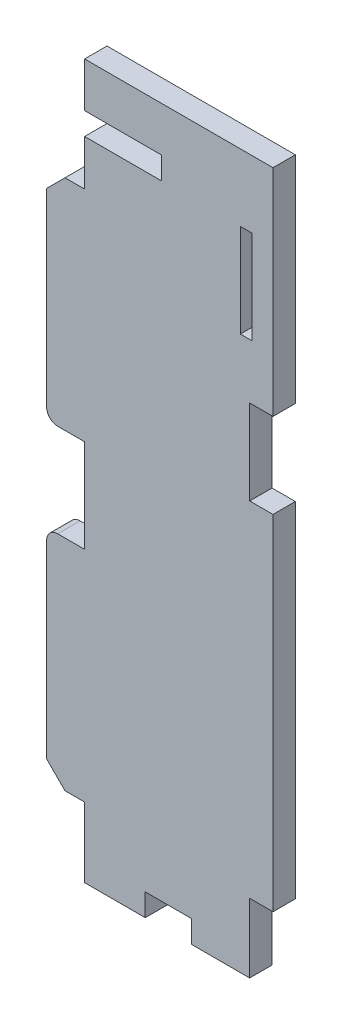
ISO-10303-21;
HEADER;
FILE_DESCRIPTION(('STEP AP214'),'2;1');
FILE_NAME('part.step','',(''),(''),'','','');
FILE_SCHEMA(('AUTOMOTIVE_DESIGN { 1 0 10303 214 1 1 1 1 }'));
ENDSEC;
DATA;
#1=APPLICATION_CONTEXT('core data for automotive mechanical design processes');
#2=APPLICATION_PROTOCOL_DEFINITION('international standard','automotive_design',2000,#1);
#3=PRODUCT_CONTEXT('',#1,'mechanical');
#4=PRODUCT('Part','Part','',(#3));
#5=PRODUCT_RELATED_PRODUCT_CATEGORY('part','',(#4));
#6=PRODUCT_DEFINITION_FORMATION('','',#4);
#7=PRODUCT_DEFINITION_CONTEXT('part definition',#1,'design');
#8=PRODUCT_DEFINITION('design','',#6,#7);
#9=PRODUCT_DEFINITION_SHAPE('','',#8);
#10=(LENGTH_UNIT() NAMED_UNIT(*) SI_UNIT(.MILLI.,.METRE.));
#11=(NAMED_UNIT(*) PLANE_ANGLE_UNIT() SI_UNIT($,.RADIAN.));
#12=(NAMED_UNIT(*) SI_UNIT($,.STERADIAN.) SOLID_ANGLE_UNIT());
#13=UNCERTAINTY_MEASURE_WITH_UNIT(LENGTH_MEASURE(1.E-05),#10,'distance_accuracy_value','');
#14=(GEOMETRIC_REPRESENTATION_CONTEXT(3) GLOBAL_UNCERTAINTY_ASSIGNED_CONTEXT((#13)) GLOBAL_UNIT_ASSIGNED_CONTEXT((#10,
#11,#12)) REPRESENTATION_CONTEXT('',''));
#15=CARTESIAN_POINT('',(0.,0.,0.));
#16=DIRECTION('',(0.,0.,1.));
#17=DIRECTION('',(1.,0.,0.));
#18=AXIS2_PLACEMENT_3D('',#15,#16,#17);
#19=CARTESIAN_POINT('',(1.49999999999995,37.8165,3.048));
#20=DIRECTION('',(0.,0.,1.));
#21=DIRECTION('',(1.,0.,0.));
#22=AXIS2_PLACEMENT_3D('',#19,#20,#21);
#23=PLANE('',#22);
#24=CARTESIAN_POINT('',(1.49999999999995,37.8165,3.048));
#25=DIRECTION('',(0.,0.,1.));
#26=DIRECTION('',(1.,0.,0.));
#27=AXIS2_PLACEMENT_3D('',#24,#25,#26);
#28=CIRCLE('',#27,1.49999999999997);
#29=CARTESIAN_POINT('',(1.49999999999995,39.3165,3.048));
#30=VERTEX_POINT('',#29);
#31=CARTESIAN_POINT('',(0.,37.8165,3.048));
#32=VERTEX_POINT('',#31);
#33=EDGE_CURVE('E289',#30,#32,#28,.T.);
#34=ORIENTED_EDGE('',*,*,#33,.T.);
#35=DIRECTION('',(0.,-1.,0.));
#36=VECTOR('',#35,1.);
#37=CARTESIAN_POINT('',(0.,12.01,3.048));
#38=LINE('',#37,#36);
#39=CARTESIAN_POINT('',(0.,12.01,3.048));
#40=VERTEX_POINT('',#39);
#41=EDGE_CURVE('E292',#32,#40,#38,.T.);
#42=ORIENTED_EDGE('',*,*,#41,.T.);
#43=DIRECTION('',(0.707106781186547,-0.707106781186549,0.));
#44=VECTOR('',#43,1.);
#45=CARTESIAN_POINT('',(0.,12.01,3.048));
#46=LINE('',#45,#44);
#47=CARTESIAN_POINT('',(2.5,9.50999999999997,3.048));
#48=VERTEX_POINT('',#47);
#49=EDGE_CURVE('E295',#40,#48,#46,.T.);
#50=ORIENTED_EDGE('',*,*,#49,.T.);
#51=DIRECTION('',(1.,0.,0.));
#52=VECTOR('',#51,1.);
#53=CARTESIAN_POINT('',(5.16999999999984,9.50999999999997,3.048));
#54=LINE('',#53,#52);
#55=CARTESIAN_POINT('',(5.16999999999984,9.50999999999997,3.048));
#56=VERTEX_POINT('',#55);
#57=EDGE_CURVE('E297',#48,#56,#54,.T.);
#58=ORIENTED_EDGE('',*,*,#57,.T.);
#59=DIRECTION('',(0.,-1.,0.));
#60=VECTOR('',#59,1.);
#61=CARTESIAN_POINT('',(5.16999999999984,9.50999999999997,3.048));
#62=LINE('',#61,#60);
#63=CARTESIAN_POINT('',(5.1699999999999,0.,3.048));
#64=VERTEX_POINT('',#63);
#65=EDGE_CURVE('E299',#56,#64,#62,.T.);
#66=ORIENTED_EDGE('',*,*,#65,.T.);
#67=DIRECTION('',(1.,0.,0.));
#68=VECTOR('',#67,1.);
#69=CARTESIAN_POINT('',(13.4249996441229,0.,3.048));
#70=LINE('',#69,#68);
#71=CARTESIAN_POINT('',(13.4249996441229,0.,3.048));
#72=VERTEX_POINT('',#71);
#73=EDGE_CURVE('E301',#64,#72,#70,.T.);
#74=ORIENTED_EDGE('',*,*,#73,.T.);
#75=DIRECTION('',(0.,1.,0.));
#76=VECTOR('',#75,1.);
#77=CARTESIAN_POINT('',(13.4249996441229,0.,3.048));
#78=LINE('',#77,#76);
#79=CARTESIAN_POINT('',(13.4249996441229,3.04799992591143,3.048));
#80=VERTEX_POINT('',#79);
#81=EDGE_CURVE('E303',#72,#80,#78,.T.);
#82=ORIENTED_EDGE('',*,*,#81,.T.);
#83=DIRECTION('',(1.,0.,0.));
#84=VECTOR('',#83,1.);
#85=CARTESIAN_POINT('',(19.7241991805657,3.04799992591143,3.048));
#86=LINE('',#85,#84);
#87=CARTESIAN_POINT('',(19.7241991805657,3.04799992591143,3.048));
#88=VERTEX_POINT('',#87);
#89=EDGE_CURVE('E305',#80,#88,#86,.T.);
#90=ORIENTED_EDGE('',*,*,#89,.T.);
#91=DIRECTION('',(0.,-1.,0.));
#92=VECTOR('',#91,1.);
#93=CARTESIAN_POINT('',(19.7241991805657,0.,3.048));
#94=LINE('',#93,#92);
#95=CARTESIAN_POINT('',(19.7241991805657,0.,3.048));
#96=VERTEX_POINT('',#95);
#97=EDGE_CURVE('E307',#88,#96,#94,.T.);
#98=ORIENTED_EDGE('',*,*,#97,.T.);
#99=DIRECTION('',(1.,0.,0.));
#100=VECTOR('',#99,1.);
#101=CARTESIAN_POINT('',(27.6489999192578,0.,3.048));
#102=LINE('',#101,#100);
#103=CARTESIAN_POINT('',(27.6489999192578,0.,3.048));
#104=VERTEX_POINT('',#103);
#105=EDGE_CURVE('E309',#96,#104,#102,.T.);
#106=ORIENTED_EDGE('',*,*,#105,.T.);
#107=DIRECTION('',(0.,1.,0.));
#108=VECTOR('',#107,1.);
#109=CARTESIAN_POINT('',(27.6489999192578,0.,3.048));
#110=LINE('',#109,#108);
#111=CARTESIAN_POINT('',(27.6489999192578,9.39799984917045,3.048));
#112=VERTEX_POINT('',#111);
#113=EDGE_CURVE('E311',#104,#112,#110,.T.);
#114=ORIENTED_EDGE('',*,*,#113,.T.);
#115=DIRECTION('',(1.,0.,0.));
#116=VECTOR('',#115,1.);
#117=CARTESIAN_POINT('',(27.6489999192578,9.39799984917045,3.048));
#118=LINE('',#117,#116);
#119=CARTESIAN_POINT('',(30.8239996480567,9.39799984917045,3.048));
#120=VERTEX_POINT('',#119);
#121=EDGE_CURVE('E313',#112,#120,#118,.T.);
#122=ORIENTED_EDGE('',*,*,#121,.T.);
#123=DIRECTION('',(0.,1.,0.));
#124=VECTOR('',#123,1.);
#125=CARTESIAN_POINT('',(30.8239996480567,9.39799984917045,3.048));
#126=LINE('',#125,#124);
#127=CARTESIAN_POINT('',(30.8239996480567,56.2610002234578,3.048));
#128=VERTEX_POINT('',#127);
#129=EDGE_CURVE('E315',#120,#128,#126,.T.);
#130=ORIENTED_EDGE('',*,*,#129,.T.);
#131=DIRECTION('',(-1.,0.,0.));
#132=VECTOR('',#131,1.);
#133=CARTESIAN_POINT('',(30.8239996480567,56.2610002234578,3.048));
#134=LINE('',#133,#132);
#135=CARTESIAN_POINT('',(27.6489999192578,56.2610002234578,3.048));
#136=VERTEX_POINT('',#135);
#137=EDGE_CURVE('E317',#128,#136,#134,.T.);
#138=ORIENTED_EDGE('',*,*,#137,.T.);
#139=DIRECTION('',(0.,1.,0.));
#140=VECTOR('',#139,1.);
#141=CARTESIAN_POINT('',(27.6489999192578,67.8179981186986,3.048));
#142=LINE('',#141,#140);
#143=CARTESIAN_POINT('',(27.6489999192578,67.8179981186986,3.048));
#144=VERTEX_POINT('',#143);
#145=EDGE_CURVE('E319',#136,#144,#142,.T.);
#146=ORIENTED_EDGE('',*,*,#145,.T.);
#147=DIRECTION('',(1.,0.,0.));
#148=VECTOR('',#147,1.);
#149=CARTESIAN_POINT('',(30.8239996480567,67.8179981186986,3.048));
#150=LINE('',#149,#148);
#151=CARTESIAN_POINT('',(30.8239996480567,67.8179981186986,3.048));
#152=VERTEX_POINT('',#151);
#153=EDGE_CURVE('E321',#144,#152,#150,.T.);
#154=ORIENTED_EDGE('',*,*,#153,.T.);
#155=DIRECTION('',(0.,1.,0.));
#156=VECTOR('',#155,1.);
#157=CARTESIAN_POINT('',(30.8239996480567,97.1549870446324,3.048));
#158=LINE('',#157,#156);
#159=CARTESIAN_POINT('',(30.8239996480567,97.1549870446324,3.048));
#160=VERTEX_POINT('',#159);
#161=EDGE_CURVE('E323',#152,#160,#158,.T.);
#162=ORIENTED_EDGE('',*,*,#161,.T.);
#163=DIRECTION('',(-1.,0.,0.));
#164=VECTOR('',#163,1.);
#165=CARTESIAN_POINT('',(5.1699999999999,97.1549870446324,3.048));
#166=LINE('',#165,#164);
#167=CARTESIAN_POINT('',(5.1699999999999,97.1549870446324,3.048));
#168=VERTEX_POINT('',#167);
#169=EDGE_CURVE('E325',#160,#168,#166,.T.);
#170=ORIENTED_EDGE('',*,*,#169,.T.);
#171=DIRECTION('',(0.,-1.,0.));
#172=VECTOR('',#171,1.);
#173=CARTESIAN_POINT('',(5.1699999999999,97.1549870446324,3.048));
#174=LINE('',#173,#172);
#175=CARTESIAN_POINT('',(5.1699999999999,91.0589965060353,3.048));
#176=VERTEX_POINT('',#175);
#177=EDGE_CURVE('E327',#168,#176,#174,.T.);
#178=ORIENTED_EDGE('',*,*,#177,.T.);
#179=DIRECTION('',(1.,0.,0.));
#180=VECTOR('',#179,1.);
#181=CARTESIAN_POINT('',(15.6347999396547,91.0589965060353,3.048));
#182=LINE('',#181,#180);
#183=CARTESIAN_POINT('',(15.6347999396547,91.0589965060353,3.048));
#184=VERTEX_POINT('',#183);
#185=EDGE_CURVE('E329',#176,#184,#182,.T.);
#186=ORIENTED_EDGE('',*,*,#185,.T.);
#187=DIRECTION('',(0.,-1.,0.));
#188=VECTOR('',#187,1.);
#189=CARTESIAN_POINT('',(15.6347999396547,91.0589965060353,3.048));
#190=LINE('',#189,#188);
#191=CARTESIAN_POINT('',(15.6347999396547,88.0110012367368,3.048));
#192=VERTEX_POINT('',#191);
#193=EDGE_CURVE('E331',#184,#192,#190,.T.);
#194=ORIENTED_EDGE('',*,*,#193,.T.);
#195=DIRECTION('',(-1.,0.,0.));
#196=VECTOR('',#195,1.);
#197=CARTESIAN_POINT('',(15.6347999396547,88.0110012367368,3.048));
#198=LINE('',#197,#196);
#199=CARTESIAN_POINT('',(5.1699999999999,88.0110012367368,3.048));
#200=VERTEX_POINT('',#199);
#201=EDGE_CURVE('E333',#192,#200,#198,.T.);
#202=ORIENTED_EDGE('',*,*,#201,.T.);
#203=DIRECTION('',(0.,-1.,0.));
#204=VECTOR('',#203,1.);
#205=CARTESIAN_POINT('',(5.1699999999999,88.0110012367368,3.048));
#206=LINE('',#205,#204);
#207=CARTESIAN_POINT('',(5.1699999999999,81.803,3.048));
#208=VERTEX_POINT('',#207);
#209=EDGE_CURVE('E335',#200,#208,#206,.T.);
#210=ORIENTED_EDGE('',*,*,#209,.T.);
#211=DIRECTION('',(-1.,0.,0.));
#212=VECTOR('',#211,1.);
#213=CARTESIAN_POINT('',(2.5,81.803,3.048));
#214=LINE('',#213,#212);
#215=CARTESIAN_POINT('',(2.5,81.803,3.048));
#216=VERTEX_POINT('',#215);
#217=EDGE_CURVE('E337',#208,#216,#214,.T.);
#218=ORIENTED_EDGE('',*,*,#217,.T.);
#219=DIRECTION('',(-0.707106781186548,-0.707106781186548,0.));
#220=VECTOR('',#219,1.);
#221=CARTESIAN_POINT('',(2.5,81.803,3.048));
#222=LINE('',#221,#220);
#223=CARTESIAN_POINT('',(0.,79.3029999999999,3.048));
#224=VERTEX_POINT('',#223);
#225=EDGE_CURVE('E339',#216,#224,#222,.T.);
#226=ORIENTED_EDGE('',*,*,#225,.T.);
#227=DIRECTION('',(0.,-1.,0.));
#228=VECTOR('',#227,1.);
#229=CARTESIAN_POINT('',(0.,53.4965,3.048));
#230=LINE('',#229,#228);
#231=CARTESIAN_POINT('',(0.,53.4965,3.048));
#232=VERTEX_POINT('',#231);
#233=EDGE_CURVE('E341',#224,#232,#230,.T.);
#234=ORIENTED_EDGE('',*,*,#233,.T.);
#235=CARTESIAN_POINT('',(1.49999999999995,53.4965,3.048));
#236=DIRECTION('',(0.,0.,1.));
#237=DIRECTION('',(1.,0.,0.));
#238=AXIS2_PLACEMENT_3D('',#235,#236,#237);
#239=CIRCLE('',#238,1.5);
#240=CARTESIAN_POINT('',(1.49999999999995,51.9965,3.048));
#241=VERTEX_POINT('',#240);
#242=EDGE_CURVE('E343',#232,#241,#239,.T.);
#243=ORIENTED_EDGE('',*,*,#242,.T.);
#244=DIRECTION('',(1.,0.,0.));
#245=VECTOR('',#244,1.);
#246=CARTESIAN_POINT('',(5.1699999999999,51.9965,3.048));
#247=LINE('',#246,#245);
#248=CARTESIAN_POINT('',(5.1699999999999,51.9965,3.048));
#249=VERTEX_POINT('',#248);
#250=EDGE_CURVE('E345',#241,#249,#247,.T.);
#251=ORIENTED_EDGE('',*,*,#250,.T.);
#252=DIRECTION('',(0.,-1.,0.));
#253=VECTOR('',#252,1.);
#254=CARTESIAN_POINT('',(5.1699999999999,51.9965,3.048));
#255=LINE('',#254,#253);
#256=CARTESIAN_POINT('',(5.1699999999999,39.3165,3.048));
#257=VERTEX_POINT('',#256);
#258=EDGE_CURVE('E347',#249,#257,#255,.T.);
#259=ORIENTED_EDGE('',*,*,#258,.T.);
#260=DIRECTION('',(-1.,0.,0.));
#261=VECTOR('',#260,1.);
#262=CARTESIAN_POINT('',(1.49999999999995,39.3165,3.048));
#263=LINE('',#262,#261);
#264=EDGE_CURVE('E349',#257,#30,#263,.T.);
#265=ORIENTED_EDGE('',*,*,#264,.T.);
#266=EDGE_LOOP('',(#34,#42,#50,#58,#66,#74,#82,#90,#98,#106,#114,#122,#130,#138,#146,#154,#162,
#170,#178,#186,#194,#202,#210,#218,#226,#234,#243,#251,#259,#265));
#267=FACE_BOUND('',#266,.T.);
#268=DIRECTION('',(-1.,0.,0.));
#269=VECTOR('',#268,1.);
#270=CARTESIAN_POINT('',(27.9537994461877,88.0110012367368,3.048));
#271=LINE('',#270,#269);
#272=CARTESIAN_POINT('',(27.9537994461877,88.0110012367368,3.048));
#273=VERTEX_POINT('',#272);
#274=CARTESIAN_POINT('',(26.3790000277383,88.0110012367368,3.048));
#275=VERTEX_POINT('',#274);
#276=EDGE_CURVE('E261',#273,#275,#271,.T.);
#277=ORIENTED_EDGE('',*,*,#276,.F.);
#278=DIRECTION('',(0.,1.,0.));
#279=VECTOR('',#278,1.);
#280=CARTESIAN_POINT('',(27.9537994461877,75.3110023215413,3.048));
#281=LINE('',#280,#279);
#282=CARTESIAN_POINT('',(27.9537994461877,75.3110023215413,3.048));
#283=VERTEX_POINT('',#282);
#284=EDGE_CURVE('E253',#283,#273,#281,.T.);
#285=ORIENTED_EDGE('',*,*,#284,.F.);
#286=DIRECTION('',(1.,0.,0.));
#287=VECTOR('',#286,1.);
#288=CARTESIAN_POINT('',(26.3790000277383,75.3110023215413,3.048));
#289=LINE('',#288,#287);
#290=CARTESIAN_POINT('',(26.3790000277383,75.3110023215413,3.048));
#291=VERTEX_POINT('',#290);
#292=EDGE_CURVE('E275',#291,#283,#289,.T.);
#293=ORIENTED_EDGE('',*,*,#292,.F.);
#294=DIRECTION('',(0.,-1.,0.));
#295=VECTOR('',#294,1.);
#296=CARTESIAN_POINT('',(26.3790000277383,88.0110012367368,3.048));
#297=LINE('',#296,#295);
#298=EDGE_CURVE('E273',#275,#291,#297,.T.);
#299=ORIENTED_EDGE('',*,*,#298,.F.);
#300=EDGE_LOOP('',(#277,#285,#293,#299));
#301=FACE_BOUND('',#300,.T.);
#302=ADVANCED_FACE('F32',(#267,#301),#23,.T.);
#303=CARTESIAN_POINT('',(1.49999999999995,37.8165,0.));
#304=DIRECTION('',(0.,0.,1.));
#305=DIRECTION('',(1.,0.,0.));
#306=AXIS2_PLACEMENT_3D('',#303,#304,#305);
#307=PLANE('',#306);
#308=CARTESIAN_POINT('',(1.49999999999995,37.8165,0.));
#309=DIRECTION('',(0.,0.,1.));
#310=DIRECTION('',(1.,0.,0.));
#311=AXIS2_PLACEMENT_3D('',#308,#309,#310);
#312=CIRCLE('',#311,1.49999999999997);
#313=CARTESIAN_POINT('',(1.49999999999995,39.3165,0.));
#314=VERTEX_POINT('',#313);
#315=CARTESIAN_POINT('',(0.,37.8165,0.));
#316=VERTEX_POINT('',#315);
#317=EDGE_CURVE('E269',#314,#316,#312,.T.);
#318=ORIENTED_EDGE('',*,*,#317,.F.);
#319=DIRECTION('',(-1.,0.,0.));
#320=VECTOR('',#319,1.);
#321=CARTESIAN_POINT('',(1.49999999999995,39.3165,0.));
#322=LINE('',#321,#320);
#323=CARTESIAN_POINT('',(5.1699999999999,39.3165,0.));
#324=VERTEX_POINT('',#323);
#325=EDGE_CURVE('E293',#324,#314,#322,.T.);
#326=ORIENTED_EDGE('',*,*,#325,.F.);
#327=DIRECTION('',(0.,-1.,0.));
#328=VECTOR('',#327,1.);
#329=CARTESIAN_POINT('',(5.1699999999999,51.9965,0.));
#330=LINE('',#329,#328);
#331=CARTESIAN_POINT('',(5.1699999999999,51.9965,0.));
#332=VERTEX_POINT('',#331);
#333=EDGE_CURVE('E409',#332,#324,#330,.T.);
#334=ORIENTED_EDGE('',*,*,#333,.F.);
#335=DIRECTION('',(1.,0.,0.));
#336=VECTOR('',#335,1.);
#337=CARTESIAN_POINT('',(5.1699999999999,51.9965,0.));
#338=LINE('',#337,#336);
#339=CARTESIAN_POINT('',(1.49999999999995,51.9965,0.));
#340=VERTEX_POINT('',#339);
#341=EDGE_CURVE('E407',#340,#332,#338,.T.);
#342=ORIENTED_EDGE('',*,*,#341,.F.);
#343=CARTESIAN_POINT('',(1.49999999999995,53.4965,0.));
#344=DIRECTION('',(0.,0.,1.));
#345=DIRECTION('',(1.,0.,0.));
#346=AXIS2_PLACEMENT_3D('',#343,#344,#345);
#347=CIRCLE('',#346,1.5);
#348=CARTESIAN_POINT('',(0.,53.4965,0.));
#349=VERTEX_POINT('',#348);
#350=EDGE_CURVE('E405',#349,#340,#347,.T.);
#351=ORIENTED_EDGE('',*,*,#350,.F.);
#352=DIRECTION('',(0.,-1.,0.));
#353=VECTOR('',#352,1.);
#354=CARTESIAN_POINT('',(0.,53.4965,0.));
#355=LINE('',#354,#353);
#356=CARTESIAN_POINT('',(0.,79.3029999999999,0.));
#357=VERTEX_POINT('',#356);
#358=EDGE_CURVE('E403',#357,#349,#355,.T.);
#359=ORIENTED_EDGE('',*,*,#358,.F.);
#360=DIRECTION('',(-0.707106781186548,-0.707106781186548,0.));
#361=VECTOR('',#360,1.);
#362=CARTESIAN_POINT('',(2.5,81.803,0.));
#363=LINE('',#362,#361);
#364=CARTESIAN_POINT('',(2.5,81.803,0.));
#365=VERTEX_POINT('',#364);
#366=EDGE_CURVE('E401',#365,#357,#363,.T.);
#367=ORIENTED_EDGE('',*,*,#366,.F.);
#368=DIRECTION('',(-1.,0.,0.));
#369=VECTOR('',#368,1.);
#370=CARTESIAN_POINT('',(2.5,81.803,0.));
#371=LINE('',#370,#369);
#372=CARTESIAN_POINT('',(5.1699999999999,81.803,0.));
#373=VERTEX_POINT('',#372);
#374=EDGE_CURVE('E399',#373,#365,#371,.T.);
#375=ORIENTED_EDGE('',*,*,#374,.F.);
#376=DIRECTION('',(0.,-1.,0.));
#377=VECTOR('',#376,1.);
#378=CARTESIAN_POINT('',(5.1699999999999,88.0110012367368,0.));
#379=LINE('',#378,#377);
#380=CARTESIAN_POINT('',(5.1699999999999,88.0110012367368,0.));
#381=VERTEX_POINT('',#380);
#382=EDGE_CURVE('E397',#381,#373,#379,.T.);
#383=ORIENTED_EDGE('',*,*,#382,.F.);
#384=DIRECTION('',(-1.,0.,0.));
#385=VECTOR('',#384,1.);
#386=CARTESIAN_POINT('',(15.6347999396547,88.0110012367368,0.));
#387=LINE('',#386,#385);
#388=CARTESIAN_POINT('',(15.6347999396547,88.0110012367368,0.));
#389=VERTEX_POINT('',#388);
#390=EDGE_CURVE('E395',#389,#381,#387,.T.);
#391=ORIENTED_EDGE('',*,*,#390,.F.);
#392=DIRECTION('',(0.,-1.,0.));
#393=VECTOR('',#392,1.);
#394=CARTESIAN_POINT('',(15.6347999396547,91.0589965060353,0.));
#395=LINE('',#394,#393);
#396=CARTESIAN_POINT('',(15.6347999396547,91.0589965060353,0.));
#397=VERTEX_POINT('',#396);
#398=EDGE_CURVE('E393',#397,#389,#395,.T.);
#399=ORIENTED_EDGE('',*,*,#398,.F.);
#400=DIRECTION('',(1.,0.,0.));
#401=VECTOR('',#400,1.);
#402=CARTESIAN_POINT('',(15.6347999396547,91.0589965060353,0.));
#403=LINE('',#402,#401);
#404=CARTESIAN_POINT('',(5.1699999999999,91.0589965060353,0.));
#405=VERTEX_POINT('',#404);
#406=EDGE_CURVE('E391',#405,#397,#403,.T.);
#407=ORIENTED_EDGE('',*,*,#406,.F.);
#408=DIRECTION('',(0.,-1.,0.));
#409=VECTOR('',#408,1.);
#410=CARTESIAN_POINT('',(5.1699999999999,97.1549870446324,0.));
#411=LINE('',#410,#409);
#412=CARTESIAN_POINT('',(5.1699999999999,97.1549870446324,0.));
#413=VERTEX_POINT('',#412);
#414=EDGE_CURVE('E389',#413,#405,#411,.T.);
#415=ORIENTED_EDGE('',*,*,#414,.F.);
#416=DIRECTION('',(-1.,0.,0.));
#417=VECTOR('',#416,1.);
#418=CARTESIAN_POINT('',(5.1699999999999,97.1549870446324,0.));
#419=LINE('',#418,#417);
#420=CARTESIAN_POINT('',(30.8239996480567,97.1549870446324,0.));
#421=VERTEX_POINT('',#420);
#422=EDGE_CURVE('E387',#421,#413,#419,.T.);
#423=ORIENTED_EDGE('',*,*,#422,.F.);
#424=DIRECTION('',(0.,1.,0.));
#425=VECTOR('',#424,1.);
#426=CARTESIAN_POINT('',(30.8239996480567,97.1549870446324,0.));
#427=LINE('',#426,#425);
#428=CARTESIAN_POINT('',(30.8239996480567,67.8179981186986,0.));
#429=VERTEX_POINT('',#428);
#430=EDGE_CURVE('E385',#429,#421,#427,.T.);
#431=ORIENTED_EDGE('',*,*,#430,.F.);
#432=DIRECTION('',(1.,0.,0.));
#433=VECTOR('',#432,1.);
#434=CARTESIAN_POINT('',(30.8239996480567,67.8179981186986,0.));
#435=LINE('',#434,#433);
#436=CARTESIAN_POINT('',(27.6489999192578,67.8179981186986,0.));
#437=VERTEX_POINT('',#436);
#438=EDGE_CURVE('E383',#437,#429,#435,.T.);
#439=ORIENTED_EDGE('',*,*,#438,.F.);
#440=DIRECTION('',(0.,1.,0.));
#441=VECTOR('',#440,1.);
#442=CARTESIAN_POINT('',(27.6489999192578,67.8179981186986,0.));
#443=LINE('',#442,#441);
#444=CARTESIAN_POINT('',(27.6489999192578,56.2610002234578,0.));
#445=VERTEX_POINT('',#444);
#446=EDGE_CURVE('E381',#445,#437,#443,.T.);
#447=ORIENTED_EDGE('',*,*,#446,.F.);
#448=DIRECTION('',(-1.,0.,0.));
#449=VECTOR('',#448,1.);
#450=CARTESIAN_POINT('',(30.8239996480567,56.2610002234578,0.));
#451=LINE('',#450,#449);
#452=CARTESIAN_POINT('',(30.8239996480567,56.2610002234578,0.));
#453=VERTEX_POINT('',#452);
#454=EDGE_CURVE('E379',#453,#445,#451,.T.);
#455=ORIENTED_EDGE('',*,*,#454,.F.);
#456=DIRECTION('',(0.,1.,0.));
#457=VECTOR('',#456,1.);
#458=CARTESIAN_POINT('',(30.8239996480567,9.39799984917045,0.));
#459=LINE('',#458,#457);
#460=CARTESIAN_POINT('',(30.8239996480567,9.39799984917045,0.));
#461=VERTEX_POINT('',#460);
#462=EDGE_CURVE('E377',#461,#453,#459,.T.);
#463=ORIENTED_EDGE('',*,*,#462,.F.);
#464=DIRECTION('',(1.,0.,0.));
#465=VECTOR('',#464,1.);
#466=CARTESIAN_POINT('',(27.6489999192578,9.39799984917045,0.));
#467=LINE('',#466,#465);
#468=CARTESIAN_POINT('',(27.6489999192578,9.39799984917045,0.));
#469=VERTEX_POINT('',#468);
#470=EDGE_CURVE('E375',#469,#461,#467,.T.);
#471=ORIENTED_EDGE('',*,*,#470,.F.);
#472=DIRECTION('',(0.,1.,0.));
#473=VECTOR('',#472,1.);
#474=CARTESIAN_POINT('',(27.6489999192578,0.,0.));
#475=LINE('',#474,#473);
#476=CARTESIAN_POINT('',(27.6489999192578,0.,0.));
#477=VERTEX_POINT('',#476);
#478=EDGE_CURVE('E373',#477,#469,#475,.T.);
#479=ORIENTED_EDGE('',*,*,#478,.F.);
#480=DIRECTION('',(1.,0.,0.));
#481=VECTOR('',#480,1.);
#482=CARTESIAN_POINT('',(27.6489999192578,0.,0.));
#483=LINE('',#482,#481);
#484=CARTESIAN_POINT('',(19.7241991805657,0.,0.));
#485=VERTEX_POINT('',#484);
#486=EDGE_CURVE('E371',#485,#477,#483,.T.);
#487=ORIENTED_EDGE('',*,*,#486,.F.);
#488=DIRECTION('',(0.,-1.,0.));
#489=VECTOR('',#488,1.);
#490=CARTESIAN_POINT('',(19.7241991805657,0.,0.));
#491=LINE('',#490,#489);
#492=CARTESIAN_POINT('',(19.7241991805657,3.04799992591143,0.));
#493=VERTEX_POINT('',#492);
#494=EDGE_CURVE('E369',#493,#485,#491,.T.);
#495=ORIENTED_EDGE('',*,*,#494,.F.);
#496=DIRECTION('',(1.,0.,0.));
#497=VECTOR('',#496,1.);
#498=CARTESIAN_POINT('',(19.7241991805657,3.04799992591143,0.));
#499=LINE('',#498,#497);
#500=CARTESIAN_POINT('',(13.4249996441229,3.04799992591143,0.));
#501=VERTEX_POINT('',#500);
#502=EDGE_CURVE('E367',#501,#493,#499,.T.);
#503=ORIENTED_EDGE('',*,*,#502,.F.);
#504=DIRECTION('',(0.,1.,0.));
#505=VECTOR('',#504,1.);
#506=CARTESIAN_POINT('',(13.4249996441229,0.,0.));
#507=LINE('',#506,#505);
#508=CARTESIAN_POINT('',(13.4249996441229,0.,0.));
#509=VERTEX_POINT('',#508);
#510=EDGE_CURVE('E365',#509,#501,#507,.T.);
#511=ORIENTED_EDGE('',*,*,#510,.F.);
#512=DIRECTION('',(1.,0.,0.));
#513=VECTOR('',#512,1.);
#514=CARTESIAN_POINT('',(13.4249996441229,0.,0.));
#515=LINE('',#514,#513);
#516=CARTESIAN_POINT('',(5.1699999999999,0.,0.));
#517=VERTEX_POINT('',#516);
#518=EDGE_CURVE('E363',#517,#509,#515,.T.);
#519=ORIENTED_EDGE('',*,*,#518,.F.);
#520=DIRECTION('',(0.,-1.,0.));
#521=VECTOR('',#520,1.);
#522=CARTESIAN_POINT('',(5.16999999999984,9.39799984917045,0.));
#523=LINE('',#522,#521);
#524=CARTESIAN_POINT('',(5.16999999999984,9.50999999999997,0.));
#525=VERTEX_POINT('',#524);
#526=EDGE_CURVE('E361',#525,#517,#523,.T.);
#527=ORIENTED_EDGE('',*,*,#526,.F.);
#528=DIRECTION('',(1.,0.,0.));
#529=VECTOR('',#528,1.);
#530=CARTESIAN_POINT('',(5.16999999999984,9.50999999999997,0.));
#531=LINE('',#530,#529);
#532=CARTESIAN_POINT('',(2.5,9.50999999999997,0.));
#533=VERTEX_POINT('',#532);
#534=EDGE_CURVE('E358',#533,#525,#531,.T.);
#535=ORIENTED_EDGE('',*,*,#534,.F.);
#536=DIRECTION('',(0.707106781186547,-0.707106781186549,0.));
#537=VECTOR('',#536,1.);
#538=CARTESIAN_POINT('',(0.,12.01,0.));
#539=LINE('',#538,#537);
#540=CARTESIAN_POINT('',(0.,12.01,0.));
#541=VERTEX_POINT('',#540);
#542=EDGE_CURVE('E356',#541,#533,#539,.T.);
#543=ORIENTED_EDGE('',*,*,#542,.F.);
#544=DIRECTION('',(0.,-1.,0.));
#545=VECTOR('',#544,1.);
#546=CARTESIAN_POINT('',(0.,12.01,0.));
#547=LINE('',#546,#545);
#548=EDGE_CURVE('E354',#316,#541,#547,.T.);
#549=ORIENTED_EDGE('',*,*,#548,.F.);
#550=EDGE_LOOP('',(#318,#326,#334,#342,#351,#359,#367,#375,#383,#391,#399,#407,#415,#423,#431,
#439,#447,#455,#463,#471,#479,#487,#495,#503,#511,#519,#527,#535,#543,#549));
#551=FACE_BOUND('',#550,.T.);
#552=DIRECTION('',(0.,1.,0.));
#553=VECTOR('',#552,1.);
#554=CARTESIAN_POINT('',(27.9537994461877,75.3110023215413,0.));
#555=LINE('',#554,#553);
#556=CARTESIAN_POINT('',(27.9537994461877,75.3110023215413,0.));
#557=VERTEX_POINT('',#556);
#558=CARTESIAN_POINT('',(27.9537994461877,88.0110012367368,0.));
#559=VERTEX_POINT('',#558);
#560=EDGE_CURVE('E55',#557,#559,#555,.T.);
#561=ORIENTED_EDGE('',*,*,#560,.T.);
#562=DIRECTION('',(-1.,0.,0.));
#563=VECTOR('',#562,1.);
#564=CARTESIAN_POINT('',(27.9537994461877,88.0110012367368,0.));
#565=LINE('',#564,#563);
#566=CARTESIAN_POINT('',(26.3790000277383,88.0110012367368,0.));
#567=VERTEX_POINT('',#566);
#568=EDGE_CURVE('E268',#559,#567,#565,.T.);
#569=ORIENTED_EDGE('',*,*,#568,.T.);
#570=DIRECTION('',(0.,-1.,0.));
#571=VECTOR('',#570,1.);
#572=CARTESIAN_POINT('',(26.3790000277383,88.0110012367368,0.));
#573=LINE('',#572,#571);
#574=CARTESIAN_POINT('',(26.3790000277383,75.3110023215413,0.));
#575=VERTEX_POINT('',#574);
#576=EDGE_CURVE('E281',#567,#575,#573,.T.);
#577=ORIENTED_EDGE('',*,*,#576,.T.);
#578=DIRECTION('',(1.,0.,0.));
#579=VECTOR('',#578,1.);
#580=CARTESIAN_POINT('',(26.3790000277383,75.3110023215413,0.));
#581=LINE('',#580,#579);
#582=EDGE_CURVE('E262',#575,#557,#581,.T.);
#583=ORIENTED_EDGE('',*,*,#582,.T.);
#584=EDGE_LOOP('',(#561,#569,#577,#583));
#585=FACE_BOUND('',#584,.T.);
#586=ADVANCED_FACE('F505',(#551,#585),#307,.F.);
#587=CARTESIAN_POINT('',(1.49999999999995,37.8165,3.048));
#588=DIRECTION('',(0.,0.,-1.));
#589=DIRECTION('',(-1.,0.,0.));
#590=AXIS2_PLACEMENT_3D('',#587,#588,#589);
#591=CYLINDRICAL_SURFACE('',#590,1.49999999999997);
#592=ORIENTED_EDGE('',*,*,#317,.T.);
#593=DIRECTION('',(0.,0.,-1.));
#594=VECTOR('',#593,1.);
#595=CARTESIAN_POINT('',(0.,37.8165,3.048));
#596=LINE('',#595,#594);
#597=EDGE_CURVE('E11',#32,#316,#596,.T.);
#598=ORIENTED_EDGE('',*,*,#597,.F.);
#599=ORIENTED_EDGE('',*,*,#33,.F.);
#600=DIRECTION('',(0.,0.,-1.));
#601=VECTOR('',#600,1.);
#602=CARTESIAN_POINT('',(1.49999999999995,39.3165,3.048));
#603=LINE('',#602,#601);
#604=EDGE_CURVE('E351',#30,#314,#603,.T.);
#605=ORIENTED_EDGE('',*,*,#604,.T.);
#606=EDGE_LOOP('',(#592,#598,#599,#605));
#607=FACE_BOUND('',#606,.T.);
#608=ADVANCED_FACE('F34',(#607),#591,.T.);
#609=CARTESIAN_POINT('',(0.,12.01,3.048));
#610=DIRECTION('',(1.,0.,0.));
#611=DIRECTION('',(0.,0.,-1.));
#612=AXIS2_PLACEMENT_3D('',#609,#610,#611);
#613=PLANE('',#612);
#614=ORIENTED_EDGE('',*,*,#548,.T.);
#615=DIRECTION('',(0.,0.,-1.));
#616=VECTOR('',#615,1.);
#617=CARTESIAN_POINT('',(0.,12.01,3.048));
#618=LINE('',#617,#616);
#619=EDGE_CURVE('E40',#40,#541,#618,.T.);
#620=ORIENTED_EDGE('',*,*,#619,.F.);
#621=ORIENTED_EDGE('',*,*,#41,.F.);
#622=ORIENTED_EDGE('',*,*,#597,.T.);
#623=EDGE_LOOP('',(#614,#620,#621,#622));
#624=FACE_BOUND('',#623,.T.);
#625=ADVANCED_FACE('F521',(#624),#613,.F.);
#626=CARTESIAN_POINT('',(0.,12.01,3.048));
#627=DIRECTION('',(0.707106781186548,0.707106781186546,0.));
#628=DIRECTION('',(-0.707106781186547,0.707106781186549,0.));
#629=AXIS2_PLACEMENT_3D('',#626,#627,#628);
#630=PLANE('',#629);
#631=ORIENTED_EDGE('',*,*,#542,.T.);
#632=DIRECTION('',(0.,0.,-1.));
#633=VECTOR('',#632,1.);
#634=CARTESIAN_POINT('',(2.5,9.50999999999997,3.048));
#635=LINE('',#634,#633);
#636=EDGE_CURVE('E492',#48,#533,#635,.T.);
#637=ORIENTED_EDGE('',*,*,#636,.F.);
#638=ORIENTED_EDGE('',*,*,#49,.F.);
#639=ORIENTED_EDGE('',*,*,#619,.T.);
#640=EDGE_LOOP('',(#631,#637,#638,#639));
#641=FACE_BOUND('',#640,.T.);
#642=ADVANCED_FACE('F499',(#641),#630,.F.);
#643=CARTESIAN_POINT('',(5.16999999999984,9.50999999999997,3.048));
#644=DIRECTION('',(0.,1.,0.));
#645=DIRECTION('',(0.,0.,1.));
#646=AXIS2_PLACEMENT_3D('',#643,#644,#645);
#647=PLANE('',#646);
#648=ORIENTED_EDGE('',*,*,#534,.T.);
#649=DIRECTION('',(0.,0.,-1.));
#650=VECTOR('',#649,1.);
#651=CARTESIAN_POINT('',(5.16999999999984,9.50999999999997,3.048));
#652=LINE('',#651,#650);
#653=EDGE_CURVE('E489',#56,#525,#652,.T.);
#654=ORIENTED_EDGE('',*,*,#653,.F.);
#655=ORIENTED_EDGE('',*,*,#57,.F.);
#656=ORIENTED_EDGE('',*,*,#636,.T.);
#657=EDGE_LOOP('',(#648,#654,#655,#656));
#658=FACE_BOUND('',#657,.T.);
#659=ADVANCED_FACE('F510',(#658),#647,.F.);
#660=CARTESIAN_POINT('',(5.16999999999984,9.39799984917045,3.048));
#661=DIRECTION('',(1.,0.,0.));
#662=DIRECTION('',(0.,1.,0.));
#663=AXIS2_PLACEMENT_3D('',#660,#661,#662);
#664=PLANE('',#663);
#665=ORIENTED_EDGE('',*,*,#526,.T.);
#666=DIRECTION('',(0.,0.,-1.));
#667=VECTOR('',#666,1.);
#668=CARTESIAN_POINT('',(5.1699999999999,0.,3.048));
#669=LINE('',#668,#667);
#670=EDGE_CURVE('E486',#64,#517,#669,.T.);
#671=ORIENTED_EDGE('',*,*,#670,.F.);
#672=ORIENTED_EDGE('',*,*,#65,.F.);
#673=ORIENTED_EDGE('',*,*,#653,.T.);
#674=EDGE_LOOP('',(#665,#671,#672,#673));
#675=FACE_BOUND('',#674,.T.);
#676=ADVANCED_FACE('F514',(#675),#664,.F.);
#677=CARTESIAN_POINT('',(13.4249996441229,0.,3.048));
#678=DIRECTION('',(0.,1.,0.));
#679=DIRECTION('',(0.,0.,1.));
#680=AXIS2_PLACEMENT_3D('',#677,#678,#679);
#681=PLANE('',#680);
#682=ORIENTED_EDGE('',*,*,#518,.T.);
#683=DIRECTION('',(0.,0.,-1.));
#684=VECTOR('',#683,1.);
#685=CARTESIAN_POINT('',(13.4249996441229,0.,3.048));
#686=LINE('',#685,#684);
#687=EDGE_CURVE('E483',#72,#509,#686,.T.);
#688=ORIENTED_EDGE('',*,*,#687,.F.);
#689=ORIENTED_EDGE('',*,*,#73,.F.);
#690=ORIENTED_EDGE('',*,*,#670,.T.);
#691=EDGE_LOOP('',(#682,#688,#689,#690));
#692=FACE_BOUND('',#691,.T.);
#693=ADVANCED_FACE('F644',(#692),#681,.F.);
#694=CARTESIAN_POINT('',(13.4249996441229,0.,3.048));
#695=DIRECTION('',(-1.,0.,0.));
#696=DIRECTION('',(0.,0.,1.));
#697=AXIS2_PLACEMENT_3D('',#694,#695,#696);
#698=PLANE('',#697);
#699=ORIENTED_EDGE('',*,*,#510,.T.);
#700=DIRECTION('',(0.,0.,-1.));
#701=VECTOR('',#700,1.);
#702=CARTESIAN_POINT('',(13.4249996441229,3.04799992591143,3.048));
#703=LINE('',#702,#701);
#704=EDGE_CURVE('E480',#80,#501,#703,.T.);
#705=ORIENTED_EDGE('',*,*,#704,.F.);
#706=ORIENTED_EDGE('',*,*,#81,.F.);
#707=ORIENTED_EDGE('',*,*,#687,.T.);
#708=EDGE_LOOP('',(#699,#705,#706,#707));
#709=FACE_BOUND('',#708,.T.);
#710=ADVANCED_FACE('F642',(#709),#698,.F.);
#711=CARTESIAN_POINT('',(19.7241991805657,3.04799992591143,3.048));
#712=DIRECTION('',(0.,1.,0.));
#713=DIRECTION('',(0.,0.,1.));
#714=AXIS2_PLACEMENT_3D('',#711,#712,#713);
#715=PLANE('',#714);
#716=ORIENTED_EDGE('',*,*,#502,.T.);
#717=DIRECTION('',(0.,0.,-1.));
#718=VECTOR('',#717,1.);
#719=CARTESIAN_POINT('',(19.7241991805657,3.04799992591143,3.048));
#720=LINE('',#719,#718);
#721=EDGE_CURVE('E477',#88,#493,#720,.T.);
#722=ORIENTED_EDGE('',*,*,#721,.F.);
#723=ORIENTED_EDGE('',*,*,#89,.F.);
#724=ORIENTED_EDGE('',*,*,#704,.T.);
#725=EDGE_LOOP('',(#716,#722,#723,#724));
#726=FACE_BOUND('',#725,.T.);
#727=ADVANCED_FACE('F638',(#726),#715,.F.);
#728=CARTESIAN_POINT('',(19.7241991805657,0.,3.048));
#729=DIRECTION('',(1.,0.,0.));
#730=DIRECTION('',(0.,0.,-1.));
#731=AXIS2_PLACEMENT_3D('',#728,#729,#730);
#732=PLANE('',#731);
#733=ORIENTED_EDGE('',*,*,#494,.T.);
#734=DIRECTION('',(0.,0.,-1.));
#735=VECTOR('',#734,1.);
#736=CARTESIAN_POINT('',(19.7241991805657,0.,3.048));
#737=LINE('',#736,#735);
#738=EDGE_CURVE('E474',#96,#485,#737,.T.);
#739=ORIENTED_EDGE('',*,*,#738,.F.);
#740=ORIENTED_EDGE('',*,*,#97,.F.);
#741=ORIENTED_EDGE('',*,*,#721,.T.);
#742=EDGE_LOOP('',(#733,#739,#740,#741));
#743=FACE_BOUND('',#742,.T.);
#744=ADVANCED_FACE('F633',(#743),#732,.F.);
#745=CARTESIAN_POINT('',(27.6489999192578,0.,3.048));
#746=DIRECTION('',(0.,1.,0.));
#747=DIRECTION('',(0.,0.,1.));
#748=AXIS2_PLACEMENT_3D('',#745,#746,#747);
#749=PLANE('',#748);
#750=ORIENTED_EDGE('',*,*,#486,.T.);
#751=DIRECTION('',(0.,0.,-1.));
#752=VECTOR('',#751,1.);
#753=CARTESIAN_POINT('',(27.6489999192578,0.,3.048));
#754=LINE('',#753,#752);
#755=EDGE_CURVE('E471',#104,#477,#754,.T.);
#756=ORIENTED_EDGE('',*,*,#755,.F.);
#757=ORIENTED_EDGE('',*,*,#105,.F.);
#758=ORIENTED_EDGE('',*,*,#738,.T.);
#759=EDGE_LOOP('',(#750,#756,#757,#758));
#760=FACE_BOUND('',#759,.T.);
#761=ADVANCED_FACE('F627',(#760),#749,.F.);
#762=CARTESIAN_POINT('',(27.6489999192578,0.,3.048));
#763=DIRECTION('',(-1.,0.,0.));
#764=DIRECTION('',(0.,0.,1.));
#765=AXIS2_PLACEMENT_3D('',#762,#763,#764);
#766=PLANE('',#765);
#767=ORIENTED_EDGE('',*,*,#478,.T.);
#768=DIRECTION('',(0.,0.,-1.));
#769=VECTOR('',#768,1.);
#770=CARTESIAN_POINT('',(27.6489999192578,9.39799984917045,3.048));
#771=LINE('',#770,#769);
#772=EDGE_CURVE('E468',#112,#469,#771,.T.);
#773=ORIENTED_EDGE('',*,*,#772,.F.);
#774=ORIENTED_EDGE('',*,*,#113,.F.);
#775=ORIENTED_EDGE('',*,*,#755,.T.);
#776=EDGE_LOOP('',(#767,#773,#774,#775));
#777=FACE_BOUND('',#776,.T.);
#778=ADVANCED_FACE('F623',(#777),#766,.F.);
#779=CARTESIAN_POINT('',(27.6489999192578,9.39799984917045,3.048));
#780=DIRECTION('',(0.,1.,0.));
#781=DIRECTION('',(0.,0.,1.));
#782=AXIS2_PLACEMENT_3D('',#779,#780,#781);
#783=PLANE('',#782);
#784=ORIENTED_EDGE('',*,*,#470,.T.);
#785=DIRECTION('',(0.,0.,-1.));
#786=VECTOR('',#785,1.);
#787=CARTESIAN_POINT('',(30.8239996480567,9.39799984917045,3.048));
#788=LINE('',#787,#786);
#789=EDGE_CURVE('E465',#120,#461,#788,.T.);
#790=ORIENTED_EDGE('',*,*,#789,.F.);
#791=ORIENTED_EDGE('',*,*,#121,.F.);
#792=ORIENTED_EDGE('',*,*,#772,.T.);
#793=EDGE_LOOP('',(#784,#790,#791,#792));
#794=FACE_BOUND('',#793,.T.);
#795=ADVANCED_FACE('F618',(#794),#783,.F.);
#796=CARTESIAN_POINT('',(30.8239996480567,9.39799984917045,3.048));
#797=DIRECTION('',(-1.,0.,0.));
#798=DIRECTION('',(0.,0.,1.));
#799=AXIS2_PLACEMENT_3D('',#796,#797,#798);
#800=PLANE('',#799);
#801=ORIENTED_EDGE('',*,*,#462,.T.);
#802=DIRECTION('',(0.,0.,-1.));
#803=VECTOR('',#802,1.);
#804=CARTESIAN_POINT('',(30.8239996480567,56.2610002234578,3.048));
#805=LINE('',#804,#803);
#806=EDGE_CURVE('E462',#128,#453,#805,.T.);
#807=ORIENTED_EDGE('',*,*,#806,.F.);
#808=ORIENTED_EDGE('',*,*,#129,.F.);
#809=ORIENTED_EDGE('',*,*,#789,.T.);
#810=EDGE_LOOP('',(#801,#807,#808,#809));
#811=FACE_BOUND('',#810,.T.);
#812=ADVANCED_FACE('F612',(#811),#800,.F.);
#813=CARTESIAN_POINT('',(30.8239996480567,56.2610002234578,3.048));
#814=DIRECTION('',(0.,-1.,0.));
#815=DIRECTION('',(0.,0.,-1.));
#816=AXIS2_PLACEMENT_3D('',#813,#814,#815);
#817=PLANE('',#816);
#818=ORIENTED_EDGE('',*,*,#454,.T.);
#819=DIRECTION('',(0.,0.,-1.));
#820=VECTOR('',#819,1.);
#821=CARTESIAN_POINT('',(27.6489999192578,56.2610002234578,3.048));
#822=LINE('',#821,#820);
#823=EDGE_CURVE('E459',#136,#445,#822,.T.);
#824=ORIENTED_EDGE('',*,*,#823,.F.);
#825=ORIENTED_EDGE('',*,*,#137,.F.);
#826=ORIENTED_EDGE('',*,*,#806,.T.);
#827=EDGE_LOOP('',(#818,#824,#825,#826));
#828=FACE_BOUND('',#827,.T.);
#829=ADVANCED_FACE('F608',(#828),#817,.F.);
#830=CARTESIAN_POINT('',(27.6489999192578,67.8179981186986,3.048));
#831=DIRECTION('',(-1.,0.,0.));
#832=DIRECTION('',(0.,0.,1.));
#833=AXIS2_PLACEMENT_3D('',#830,#831,#832);
#834=PLANE('',#833);
#835=ORIENTED_EDGE('',*,*,#446,.T.);
#836=DIRECTION('',(0.,0.,-1.));
#837=VECTOR('',#836,1.);
#838=CARTESIAN_POINT('',(27.6489999192578,67.8179981186986,3.048));
#839=LINE('',#838,#837);
#840=EDGE_CURVE('E456',#144,#437,#839,.T.);
#841=ORIENTED_EDGE('',*,*,#840,.F.);
#842=ORIENTED_EDGE('',*,*,#145,.F.);
#843=ORIENTED_EDGE('',*,*,#823,.T.);
#844=EDGE_LOOP('',(#835,#841,#842,#843));
#845=FACE_BOUND('',#844,.T.);
#846=ADVANCED_FACE('F603',(#845),#834,.F.);
#847=CARTESIAN_POINT('',(30.8239996480567,67.8179981186986,3.048));
#848=DIRECTION('',(0.,1.,0.));
#849=DIRECTION('',(0.,0.,1.));
#850=AXIS2_PLACEMENT_3D('',#847,#848,#849);
#851=PLANE('',#850);
#852=ORIENTED_EDGE('',*,*,#438,.T.);
#853=DIRECTION('',(0.,0.,-1.));
#854=VECTOR('',#853,1.);
#855=CARTESIAN_POINT('',(30.8239996480567,67.8179981186986,3.048));
#856=LINE('',#855,#854);
#857=EDGE_CURVE('E453',#152,#429,#856,.T.);
#858=ORIENTED_EDGE('',*,*,#857,.F.);
#859=ORIENTED_EDGE('',*,*,#153,.F.);
#860=ORIENTED_EDGE('',*,*,#840,.T.);
#861=EDGE_LOOP('',(#852,#858,#859,#860));
#862=FACE_BOUND('',#861,.T.);
#863=ADVANCED_FACE('F597',(#862),#851,.F.);
#864=CARTESIAN_POINT('',(30.8239996480567,97.1549870446324,3.048));
#865=DIRECTION('',(-1.,0.,0.));
#866=DIRECTION('',(0.,0.,1.));
#867=AXIS2_PLACEMENT_3D('',#864,#865,#866);
#868=PLANE('',#867);
#869=ORIENTED_EDGE('',*,*,#430,.T.);
#870=DIRECTION('',(0.,0.,-1.));
#871=VECTOR('',#870,1.);
#872=CARTESIAN_POINT('',(30.8239996480567,97.1549870446324,3.048));
#873=LINE('',#872,#871);
#874=EDGE_CURVE('E450',#160,#421,#873,.T.);
#875=ORIENTED_EDGE('',*,*,#874,.F.);
#876=ORIENTED_EDGE('',*,*,#161,.F.);
#877=ORIENTED_EDGE('',*,*,#857,.T.);
#878=EDGE_LOOP('',(#869,#875,#876,#877));
#879=FACE_BOUND('',#878,.T.);
#880=ADVANCED_FACE('F593',(#879),#868,.F.);
#881=CARTESIAN_POINT('',(5.1699999999999,97.1549870446324,3.048));
#882=DIRECTION('',(0.,-1.,0.));
#883=DIRECTION('',(0.,0.,-1.));
#884=AXIS2_PLACEMENT_3D('',#881,#882,#883);
#885=PLANE('',#884);
#886=ORIENTED_EDGE('',*,*,#422,.T.);
#887=DIRECTION('',(0.,0.,-1.));
#888=VECTOR('',#887,1.);
#889=CARTESIAN_POINT('',(5.1699999999999,97.1549870446324,3.048));
#890=LINE('',#889,#888);
#891=EDGE_CURVE('E447',#168,#413,#890,.T.);
#892=ORIENTED_EDGE('',*,*,#891,.F.);
#893=ORIENTED_EDGE('',*,*,#169,.F.);
#894=ORIENTED_EDGE('',*,*,#874,.T.);
#895=EDGE_LOOP('',(#886,#892,#893,#894));
#896=FACE_BOUND('',#895,.T.);
#897=ADVANCED_FACE('F588',(#896),#885,.F.);
#898=CARTESIAN_POINT('',(5.1699999999999,97.1549870446324,3.048));
#899=DIRECTION('',(1.,0.,0.));
#900=DIRECTION('',(0.,0.,-1.));
#901=AXIS2_PLACEMENT_3D('',#898,#899,#900);
#902=PLANE('',#901);
#903=ORIENTED_EDGE('',*,*,#414,.T.);
#904=DIRECTION('',(0.,0.,-1.));
#905=VECTOR('',#904,1.);
#906=CARTESIAN_POINT('',(5.1699999999999,91.0589965060353,3.048));
#907=LINE('',#906,#905);
#908=EDGE_CURVE('E444',#176,#405,#907,.T.);
#909=ORIENTED_EDGE('',*,*,#908,.F.);
#910=ORIENTED_EDGE('',*,*,#177,.F.);
#911=ORIENTED_EDGE('',*,*,#891,.T.);
#912=EDGE_LOOP('',(#903,#909,#910,#911));
#913=FACE_BOUND('',#912,.T.);
#914=ADVANCED_FACE('F582',(#913),#902,.F.);
#915=CARTESIAN_POINT('',(15.6347999396547,91.0589965060353,3.048));
#916=DIRECTION('',(0.,1.,0.));
#917=DIRECTION('',(0.,0.,1.));
#918=AXIS2_PLACEMENT_3D('',#915,#916,#917);
#919=PLANE('',#918);
#920=ORIENTED_EDGE('',*,*,#406,.T.);
#921=DIRECTION('',(0.,0.,-1.));
#922=VECTOR('',#921,1.);
#923=CARTESIAN_POINT('',(15.6347999396547,91.0589965060353,3.048));
#924=LINE('',#923,#922);
#925=EDGE_CURVE('E441',#184,#397,#924,.T.);
#926=ORIENTED_EDGE('',*,*,#925,.F.);
#927=ORIENTED_EDGE('',*,*,#185,.F.);
#928=ORIENTED_EDGE('',*,*,#908,.T.);
#929=EDGE_LOOP('',(#920,#926,#927,#928));
#930=FACE_BOUND('',#929,.T.);
#931=ADVANCED_FACE('F578',(#930),#919,.F.);
#932=CARTESIAN_POINT('',(15.6347999396547,91.0589965060353,3.048));
#933=DIRECTION('',(1.,0.,0.));
#934=DIRECTION('',(0.,0.,-1.));
#935=AXIS2_PLACEMENT_3D('',#932,#933,#934);
#936=PLANE('',#935);
#937=ORIENTED_EDGE('',*,*,#398,.T.);
#938=DIRECTION('',(0.,0.,-1.));
#939=VECTOR('',#938,1.);
#940=CARTESIAN_POINT('',(15.6347999396547,88.0110012367368,3.048));
#941=LINE('',#940,#939);
#942=EDGE_CURVE('E438',#192,#389,#941,.T.);
#943=ORIENTED_EDGE('',*,*,#942,.F.);
#944=ORIENTED_EDGE('',*,*,#193,.F.);
#945=ORIENTED_EDGE('',*,*,#925,.T.);
#946=EDGE_LOOP('',(#937,#943,#944,#945));
#947=FACE_BOUND('',#946,.T.);
#948=ADVANCED_FACE('F573',(#947),#936,.F.);
#949=CARTESIAN_POINT('',(15.6347999396547,88.0110012367368,3.048));
#950=DIRECTION('',(0.,-1.,0.));
#951=DIRECTION('',(0.,0.,-1.));
#952=AXIS2_PLACEMENT_3D('',#949,#950,#951);
#953=PLANE('',#952);
#954=ORIENTED_EDGE('',*,*,#390,.T.);
#955=DIRECTION('',(0.,0.,-1.));
#956=VECTOR('',#955,1.);
#957=CARTESIAN_POINT('',(5.1699999999999,88.0110012367368,3.048));
#958=LINE('',#957,#956);
#959=EDGE_CURVE('E435',#200,#381,#958,.T.);
#960=ORIENTED_EDGE('',*,*,#959,.F.);
#961=ORIENTED_EDGE('',*,*,#201,.F.);
#962=ORIENTED_EDGE('',*,*,#942,.T.);
#963=EDGE_LOOP('',(#954,#960,#961,#962));
#964=FACE_BOUND('',#963,.T.);
#965=ADVANCED_FACE('F567',(#964),#953,.F.);
#966=CARTESIAN_POINT('',(5.1699999999999,88.0110012367368,3.048));
#967=DIRECTION('',(1.,0.,0.));
#968=DIRECTION('',(0.,0.,-1.));
#969=AXIS2_PLACEMENT_3D('',#966,#967,#968);
#970=PLANE('',#969);
#971=ORIENTED_EDGE('',*,*,#382,.T.);
#972=DIRECTION('',(0.,0.,-1.));
#973=VECTOR('',#972,1.);
#974=CARTESIAN_POINT('',(5.1699999999999,81.803,3.048));
#975=LINE('',#974,#973);
#976=EDGE_CURVE('E432',#208,#373,#975,.T.);
#977=ORIENTED_EDGE('',*,*,#976,.F.);
#978=ORIENTED_EDGE('',*,*,#209,.F.);
#979=ORIENTED_EDGE('',*,*,#959,.T.);
#980=EDGE_LOOP('',(#971,#977,#978,#979));
#981=FACE_BOUND('',#980,.T.);
#982=ADVANCED_FACE('F563',(#981),#970,.F.);
#983=CARTESIAN_POINT('',(2.5,81.803,3.048));
#984=DIRECTION('',(0.,-1.,0.));
#985=DIRECTION('',(0.,0.,-1.));
#986=AXIS2_PLACEMENT_3D('',#983,#984,#985);
#987=PLANE('',#986);
#988=ORIENTED_EDGE('',*,*,#374,.T.);
#989=DIRECTION('',(0.,0.,-1.));
#990=VECTOR('',#989,1.);
#991=CARTESIAN_POINT('',(2.5,81.803,3.048));
#992=LINE('',#991,#990);
#993=EDGE_CURVE('E429',#216,#365,#992,.T.);
#994=ORIENTED_EDGE('',*,*,#993,.F.);
#995=ORIENTED_EDGE('',*,*,#217,.F.);
#996=ORIENTED_EDGE('',*,*,#976,.T.);
#997=EDGE_LOOP('',(#988,#994,#995,#996));
#998=FACE_BOUND('',#997,.T.);
#999=ADVANCED_FACE('F558',(#998),#987,.F.);
#1000=CARTESIAN_POINT('',(2.5,81.803,3.048));
#1001=DIRECTION('',(0.707106781186547,-0.707106781186547,0.));
#1002=DIRECTION('',(0.707106781186548,0.707106781186548,0.));
#1003=AXIS2_PLACEMENT_3D('',#1000,#1001,#1002);
#1004=PLANE('',#1003);
#1005=ORIENTED_EDGE('',*,*,#366,.T.);
#1006=DIRECTION('',(0.,0.,-1.));
#1007=VECTOR('',#1006,1.);
#1008=CARTESIAN_POINT('',(0.,79.3029999999999,3.048));
#1009=LINE('',#1008,#1007);
#1010=EDGE_CURVE('E426',#224,#357,#1009,.T.);
#1011=ORIENTED_EDGE('',*,*,#1010,.F.);
#1012=ORIENTED_EDGE('',*,*,#225,.F.);
#1013=ORIENTED_EDGE('',*,*,#993,.T.);
#1014=EDGE_LOOP('',(#1005,#1011,#1012,#1013));
#1015=FACE_BOUND('',#1014,.T.);
#1016=ADVANCED_FACE('F552',(#1015),#1004,.F.);
#1017=CARTESIAN_POINT('',(0.,53.4965,3.048));
#1018=DIRECTION('',(1.,0.,0.));
#1019=DIRECTION('',(0.,0.,-1.));
#1020=AXIS2_PLACEMENT_3D('',#1017,#1018,#1019);
#1021=PLANE('',#1020);
#1022=ORIENTED_EDGE('',*,*,#358,.T.);
#1023=DIRECTION('',(0.,0.,-1.));
#1024=VECTOR('',#1023,1.);
#1025=CARTESIAN_POINT('',(0.,53.4965,3.048));
#1026=LINE('',#1025,#1024);
#1027=EDGE_CURVE('E423',#232,#349,#1026,.T.);
#1028=ORIENTED_EDGE('',*,*,#1027,.F.);
#1029=ORIENTED_EDGE('',*,*,#233,.F.);
#1030=ORIENTED_EDGE('',*,*,#1010,.T.);
#1031=EDGE_LOOP('',(#1022,#1028,#1029,#1030));
#1032=FACE_BOUND('',#1031,.T.);
#1033=ADVANCED_FACE('F548',(#1032),#1021,.F.);
#1034=CARTESIAN_POINT('',(1.49999999999995,53.4965,3.048));
#1035=DIRECTION('',(0.,0.,-1.));
#1036=DIRECTION('',(-1.,0.,0.));
#1037=AXIS2_PLACEMENT_3D('',#1034,#1035,#1036);
#1038=CYLINDRICAL_SURFACE('',#1037,1.5);
#1039=ORIENTED_EDGE('',*,*,#350,.T.);
#1040=DIRECTION('',(0.,0.,-1.));
#1041=VECTOR('',#1040,1.);
#1042=CARTESIAN_POINT('',(1.49999999999995,51.9965,3.048));
#1043=LINE('',#1042,#1041);
#1044=EDGE_CURVE('E420',#241,#340,#1043,.T.);
#1045=ORIENTED_EDGE('',*,*,#1044,.F.);
#1046=ORIENTED_EDGE('',*,*,#242,.F.);
#1047=ORIENTED_EDGE('',*,*,#1027,.T.);
#1048=EDGE_LOOP('',(#1039,#1045,#1046,#1047));
#1049=FACE_BOUND('',#1048,.T.);
#1050=ADVANCED_FACE('F543',(#1049),#1038,.T.);
#1051=CARTESIAN_POINT('',(5.1699999999999,51.9965,3.048));
#1052=DIRECTION('',(0.,1.,0.));
#1053=DIRECTION('',(0.,0.,1.));
#1054=AXIS2_PLACEMENT_3D('',#1051,#1052,#1053);
#1055=PLANE('',#1054);
#1056=ORIENTED_EDGE('',*,*,#341,.T.);
#1057=DIRECTION('',(0.,0.,-1.));
#1058=VECTOR('',#1057,1.);
#1059=CARTESIAN_POINT('',(5.1699999999999,51.9965,3.048));
#1060=LINE('',#1059,#1058);
#1061=EDGE_CURVE('E417',#249,#332,#1060,.T.);
#1062=ORIENTED_EDGE('',*,*,#1061,.F.);
#1063=ORIENTED_EDGE('',*,*,#250,.F.);
#1064=ORIENTED_EDGE('',*,*,#1044,.T.);
#1065=EDGE_LOOP('',(#1056,#1062,#1063,#1064));
#1066=FACE_BOUND('',#1065,.T.);
#1067=ADVANCED_FACE('F537',(#1066),#1055,.F.);
#1068=CARTESIAN_POINT('',(5.1699999999999,51.9965,3.048));
#1069=DIRECTION('',(1.,0.,0.));
#1070=DIRECTION('',(0.,0.,-1.));
#1071=AXIS2_PLACEMENT_3D('',#1068,#1069,#1070);
#1072=PLANE('',#1071);
#1073=ORIENTED_EDGE('',*,*,#333,.T.);
#1074=DIRECTION('',(0.,0.,-1.));
#1075=VECTOR('',#1074,1.);
#1076=CARTESIAN_POINT('',(5.1699999999999,39.3165,3.048));
#1077=LINE('',#1076,#1075);
#1078=EDGE_CURVE('E414',#257,#324,#1077,.T.);
#1079=ORIENTED_EDGE('',*,*,#1078,.F.);
#1080=ORIENTED_EDGE('',*,*,#258,.F.);
#1081=ORIENTED_EDGE('',*,*,#1061,.T.);
#1082=EDGE_LOOP('',(#1073,#1079,#1080,#1081));
#1083=FACE_BOUND('',#1082,.T.);
#1084=ADVANCED_FACE('F533',(#1083),#1072,.F.);
#1085=CARTESIAN_POINT('',(1.49999999999995,39.3165,3.048));
#1086=DIRECTION('',(0.,-1.,0.));
#1087=DIRECTION('',(0.,0.,-1.));
#1088=AXIS2_PLACEMENT_3D('',#1085,#1086,#1087);
#1089=PLANE('',#1088);
#1090=ORIENTED_EDGE('',*,*,#325,.T.);
#1091=ORIENTED_EDGE('',*,*,#604,.F.);
#1092=ORIENTED_EDGE('',*,*,#264,.F.);
#1093=ORIENTED_EDGE('',*,*,#1078,.T.);
#1094=EDGE_LOOP('',(#1090,#1091,#1092,#1093));
#1095=FACE_BOUND('',#1094,.T.);
#1096=ADVANCED_FACE('F528',(#1095),#1089,.F.);
#1097=CARTESIAN_POINT('',(27.9537994461877,75.3110023215413,3.048));
#1098=DIRECTION('',(-1.,0.,0.));
#1099=DIRECTION('',(0.,0.,1.));
#1100=AXIS2_PLACEMENT_3D('',#1097,#1098,#1099);
#1101=PLANE('',#1100);
#1102=ORIENTED_EDGE('',*,*,#560,.F.);
#1103=DIRECTION('',(0.,0.,-1.));
#1104=VECTOR('',#1103,1.);
#1105=CARTESIAN_POINT('',(27.9537994461877,75.3110023215413,3.048));
#1106=LINE('',#1105,#1104);
#1107=EDGE_CURVE('E257',#283,#557,#1106,.T.);
#1108=ORIENTED_EDGE('',*,*,#1107,.F.);
#1109=ORIENTED_EDGE('',*,*,#284,.T.);
#1110=DIRECTION('',(0.,0.,-1.));
#1111=VECTOR('',#1110,1.);
#1112=CARTESIAN_POINT('',(27.9537994461877,88.0110012367368,3.048));
#1113=LINE('',#1112,#1111);
#1114=EDGE_CURVE('E256',#273,#559,#1113,.T.);
#1115=ORIENTED_EDGE('',*,*,#1114,.T.);
#1116=EDGE_LOOP('',(#1102,#1108,#1109,#1115));
#1117=FACE_BOUND('',#1116,.T.);
#1118=ADVANCED_FACE('F255',(#1117),#1101,.T.);
#1119=CARTESIAN_POINT('',(27.9537994461877,88.0110012367368,3.048));
#1120=DIRECTION('',(0.,-1.,0.));
#1121=DIRECTION('',(0.,0.,-1.));
#1122=AXIS2_PLACEMENT_3D('',#1119,#1120,#1121);
#1123=PLANE('',#1122);
#1124=ORIENTED_EDGE('',*,*,#568,.F.);
#1125=ORIENTED_EDGE('',*,*,#1114,.F.);
#1126=ORIENTED_EDGE('',*,*,#276,.T.);
#1127=DIRECTION('',(0.,0.,-1.));
#1128=VECTOR('',#1127,1.);
#1129=CARTESIAN_POINT('',(26.3790000277383,88.0110012367368,3.048));
#1130=LINE('',#1129,#1128);
#1131=EDGE_CURVE('E270',#275,#567,#1130,.T.);
#1132=ORIENTED_EDGE('',*,*,#1131,.T.);
#1133=EDGE_LOOP('',(#1124,#1125,#1126,#1132));
#1134=FACE_BOUND('',#1133,.T.);
#1135=ADVANCED_FACE('F265',(#1134),#1123,.T.);
#1136=CARTESIAN_POINT('',(26.3790000277383,88.0110012367368,3.048));
#1137=DIRECTION('',(1.,0.,0.));
#1138=DIRECTION('',(0.,0.,-1.));
#1139=AXIS2_PLACEMENT_3D('',#1136,#1137,#1138);
#1140=PLANE('',#1139);
#1141=ORIENTED_EDGE('',*,*,#576,.F.);
#1142=ORIENTED_EDGE('',*,*,#1131,.F.);
#1143=ORIENTED_EDGE('',*,*,#298,.T.);
#1144=DIRECTION('',(0.,0.,-1.));
#1145=VECTOR('',#1144,1.);
#1146=CARTESIAN_POINT('',(26.3790000277383,75.3110023215413,3.048));
#1147=LINE('',#1146,#1145);
#1148=EDGE_CURVE('E47',#291,#575,#1147,.T.);
#1149=ORIENTED_EDGE('',*,*,#1148,.T.);
#1150=EDGE_LOOP('',(#1141,#1142,#1143,#1149));
#1151=FACE_BOUND('',#1150,.T.);
#1152=ADVANCED_FACE('F810',(#1151),#1140,.T.);
#1153=CARTESIAN_POINT('',(26.3790000277383,75.3110023215413,3.048));
#1154=DIRECTION('',(0.,1.,0.));
#1155=DIRECTION('',(0.,0.,1.));
#1156=AXIS2_PLACEMENT_3D('',#1153,#1154,#1155);
#1157=PLANE('',#1156);
#1158=ORIENTED_EDGE('',*,*,#582,.F.);
#1159=ORIENTED_EDGE('',*,*,#1148,.F.);
#1160=ORIENTED_EDGE('',*,*,#292,.T.);
#1161=ORIENTED_EDGE('',*,*,#1107,.T.);
#1162=EDGE_LOOP('',(#1158,#1159,#1160,#1161));
#1163=FACE_BOUND('',#1162,.T.);
#1164=ADVANCED_FACE('F816',(#1163),#1157,.T.);
#1165=CLOSED_SHELL('',(#302,#586,#608,#625,#642,#659,#676,#693,#710,#727,#744,#761,#778,#795,
#812,#829,#846,#863,#880,#897,#914,#931,#948,#965,#982,#999,#1016,#1033,#1050,#1067,#1084,#1096,
#1118,#1135,#1152,#1164));
#1166=MANIFOLD_SOLID_BREP('B2',#1165);
#1167=ADVANCED_BREP_SHAPE_REPRESENTATION('',(#18,#1166),#14);
#1168=SHAPE_DEFINITION_REPRESENTATION(#9,#1167);
ENDSEC;
END-ISO-10303-21;
